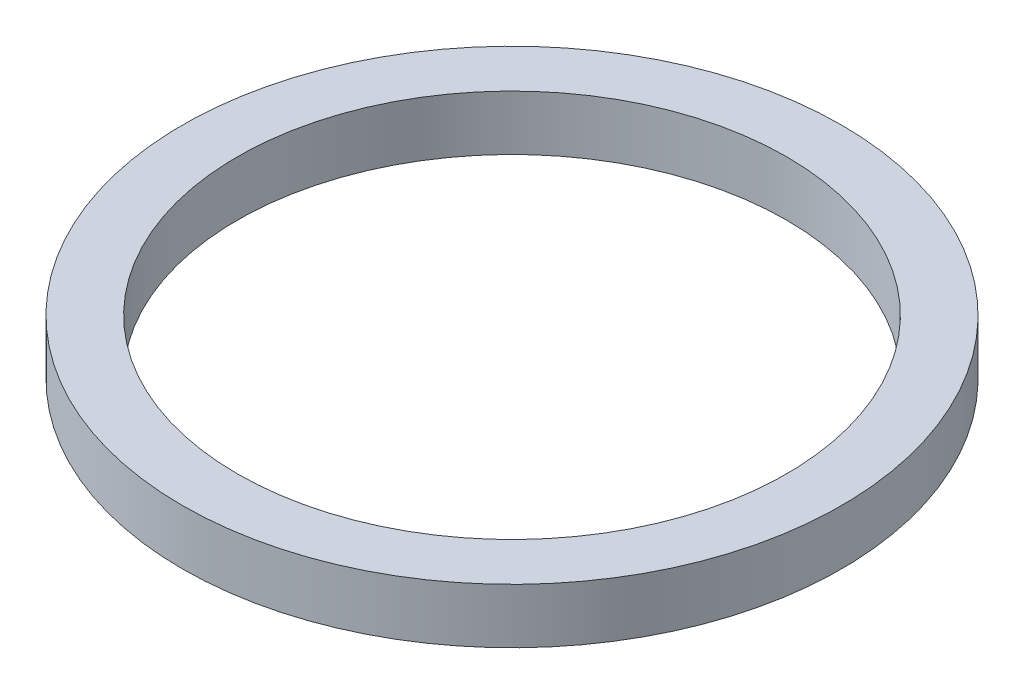
ISO-10303-21;
HEADER;
FILE_DESCRIPTION(('STEP AP214'),'2;1');
FILE_NAME('part.step','',(''),(''),'','','');
FILE_SCHEMA(('AUTOMOTIVE_DESIGN { 1 0 10303 214 1 1 1 1 }'));
ENDSEC;
DATA;
#1=APPLICATION_CONTEXT('core data for automotive mechanical design processes');
#2=APPLICATION_PROTOCOL_DEFINITION('international standard','automotive_design',2000,#1);
#3=PRODUCT_CONTEXT('',#1,'mechanical');
#4=PRODUCT('Part','Part','',(#3));
#5=PRODUCT_RELATED_PRODUCT_CATEGORY('part','',(#4));
#6=PRODUCT_DEFINITION_FORMATION('','',#4);
#7=PRODUCT_DEFINITION_CONTEXT('part definition',#1,'design');
#8=PRODUCT_DEFINITION('design','',#6,#7);
#9=PRODUCT_DEFINITION_SHAPE('','',#8);
#10=(LENGTH_UNIT() NAMED_UNIT(*) SI_UNIT(.MILLI.,.METRE.));
#11=(NAMED_UNIT(*) PLANE_ANGLE_UNIT() SI_UNIT($,.RADIAN.));
#12=(NAMED_UNIT(*) SI_UNIT($,.STERADIAN.) SOLID_ANGLE_UNIT());
#13=UNCERTAINTY_MEASURE_WITH_UNIT(LENGTH_MEASURE(1.E-05),#10,'distance_accuracy_value','');
#14=(GEOMETRIC_REPRESENTATION_CONTEXT(3) GLOBAL_UNCERTAINTY_ASSIGNED_CONTEXT((#13)) GLOBAL_UNIT_ASSIGNED_CONTEXT((#10,
#11,#12)) REPRESENTATION_CONTEXT('',''));
#15=CARTESIAN_POINT('',(0.,0.,0.));
#16=DIRECTION('',(0.,0.,1.));
#17=DIRECTION('',(1.,0.,0.));
#18=AXIS2_PLACEMENT_3D('',#15,#16,#17);
#19=CARTESIAN_POINT('',(0.,5.,0.));
#20=DIRECTION('',(0.,1.,0.));
#21=DIRECTION('',(0.,0.,1.));
#22=AXIS2_PLACEMENT_3D('',#19,#20,#21);
#23=PLANE('',#22);
#24=CARTESIAN_POINT('',(0.,5.,0.));
#25=DIRECTION('',(0.,1.,0.));
#26=DIRECTION('',(0.,0.,1.));
#27=AXIS2_PLACEMENT_3D('',#24,#25,#26);
#28=CIRCLE('',#27,30.);
#29=CARTESIAN_POINT('',(0.,5.,30.));
#30=VERTEX_POINT('',#29);
#31=EDGE_CURVE('E10',#30,#30,#28,.T.);
#32=ORIENTED_EDGE('',*,*,#31,.T.);
#33=EDGE_LOOP('',(#32));
#34=FACE_BOUND('',#33,.T.);
#35=CARTESIAN_POINT('',(0.,5.,0.));
#36=DIRECTION('',(0.,1.,0.));
#37=DIRECTION('',(0.,0.,1.));
#38=AXIS2_PLACEMENT_3D('',#35,#36,#37);
#39=CIRCLE('',#38,25.);
#40=CARTESIAN_POINT('',(0.,5.,25.));
#41=VERTEX_POINT('',#40);
#42=EDGE_CURVE('E42',#41,#41,#39,.T.);
#43=ORIENTED_EDGE('',*,*,#42,.F.);
#44=EDGE_LOOP('',(#43));
#45=FACE_BOUND('',#44,.T.);
#46=ADVANCED_FACE('F31',(#34,#45),#23,.T.);
#47=CARTESIAN_POINT('',(0.,0.,0.));
#48=DIRECTION('',(0.,1.,0.));
#49=DIRECTION('',(0.,0.,1.));
#50=AXIS2_PLACEMENT_3D('',#47,#48,#49);
#51=PLANE('',#50);
#52=CARTESIAN_POINT('',(0.,0.,0.));
#53=DIRECTION('',(0.,1.,0.));
#54=DIRECTION('',(0.,0.,1.));
#55=AXIS2_PLACEMENT_3D('',#52,#53,#54);
#56=CIRCLE('',#55,30.);
#57=CARTESIAN_POINT('',(0.,0.,30.));
#58=VERTEX_POINT('',#57);
#59=EDGE_CURVE('E35',#58,#58,#56,.T.);
#60=ORIENTED_EDGE('',*,*,#59,.F.);
#61=EDGE_LOOP('',(#60));
#62=FACE_BOUND('',#61,.T.);
#63=CARTESIAN_POINT('',(0.,0.,0.));
#64=DIRECTION('',(0.,1.,0.));
#65=DIRECTION('',(0.,0.,1.));
#66=AXIS2_PLACEMENT_3D('',#63,#64,#65);
#67=CIRCLE('',#66,25.);
#68=CARTESIAN_POINT('',(0.,0.,25.));
#69=VERTEX_POINT('',#68);
#70=EDGE_CURVE('E44',#69,#69,#67,.T.);
#71=ORIENTED_EDGE('',*,*,#70,.T.);
#72=EDGE_LOOP('',(#71));
#73=FACE_BOUND('',#72,.T.);
#74=ADVANCED_FACE('F54',(#62,#73),#51,.F.);
#75=CARTESIAN_POINT('',(0.,5.,0.));
#76=DIRECTION('',(0.,-1.,0.));
#77=DIRECTION('',(0.,0.,-1.));
#78=AXIS2_PLACEMENT_3D('',#75,#76,#77);
#79=CYLINDRICAL_SURFACE('',#78,30.);
#80=ORIENTED_EDGE('',*,*,#31,.F.);
#81=EDGE_LOOP('',(#80));
#82=FACE_BOUND('',#81,.T.);
#83=ORIENTED_EDGE('',*,*,#59,.T.);
#84=EDGE_LOOP('',(#83));
#85=FACE_BOUND('',#84,.T.);
#86=ADVANCED_FACE('F33',(#82,#85),#79,.T.);
#87=CARTESIAN_POINT('',(0.,5.,0.));
#88=DIRECTION('',(0.,-1.,0.));
#89=DIRECTION('',(0.,0.,-1.));
#90=AXIS2_PLACEMENT_3D('',#87,#88,#89);
#91=CYLINDRICAL_SURFACE('',#90,25.);
#92=ORIENTED_EDGE('',*,*,#42,.T.);
#93=EDGE_LOOP('',(#92));
#94=FACE_BOUND('',#93,.T.);
#95=ORIENTED_EDGE('',*,*,#70,.F.);
#96=EDGE_LOOP('',(#95));
#97=FACE_BOUND('',#96,.T.);
#98=ADVANCED_FACE('F50',(#94,#97),#91,.F.);
#99=CLOSED_SHELL('',(#46,#74,#86,#98));
#100=MANIFOLD_SOLID_BREP('B2',#99);
#101=ADVANCED_BREP_SHAPE_REPRESENTATION('',(#18,#100),#14);
#102=SHAPE_DEFINITION_REPRESENTATION(#9,#101);
ENDSEC;
END-ISO-10303-21;
